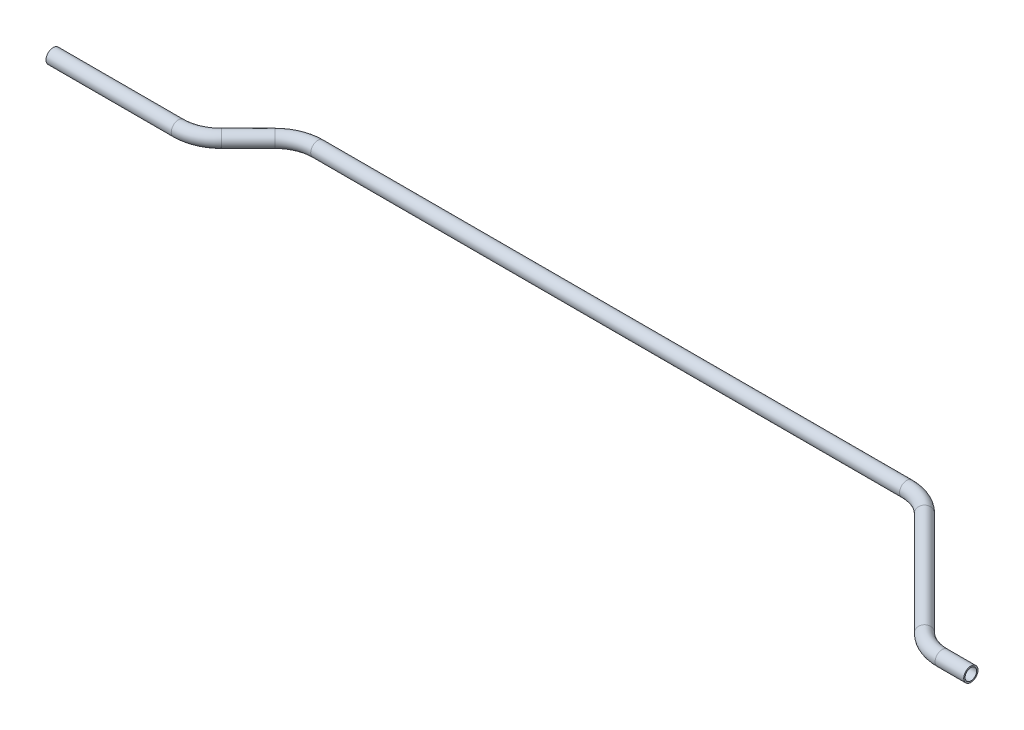
ISO-10303-21;
HEADER;
FILE_DESCRIPTION(('STEP AP214'),'2;1');
FILE_NAME('part.step','',(''),(''),'','','');
FILE_SCHEMA(('AUTOMOTIVE_DESIGN { 1 0 10303 214 1 1 1 1 }'));
ENDSEC;
DATA;
#1=APPLICATION_CONTEXT('core data for automotive mechanical design processes');
#2=APPLICATION_PROTOCOL_DEFINITION('international standard','automotive_design',2000,#1);
#3=PRODUCT_CONTEXT('',#1,'mechanical');
#4=PRODUCT('Part','Part','',(#3));
#5=PRODUCT_RELATED_PRODUCT_CATEGORY('part','',(#4));
#6=PRODUCT_DEFINITION_FORMATION('','',#4);
#7=PRODUCT_DEFINITION_CONTEXT('part definition',#1,'design');
#8=PRODUCT_DEFINITION('design','',#6,#7);
#9=PRODUCT_DEFINITION_SHAPE('','',#8);
#10=(LENGTH_UNIT() NAMED_UNIT(*) SI_UNIT(.MILLI.,.METRE.));
#11=(NAMED_UNIT(*) PLANE_ANGLE_UNIT() SI_UNIT($,.RADIAN.));
#12=(NAMED_UNIT(*) SI_UNIT($,.STERADIAN.) SOLID_ANGLE_UNIT());
#13=UNCERTAINTY_MEASURE_WITH_UNIT(LENGTH_MEASURE(1.E-05),#10,'distance_accuracy_value','');
#14=(GEOMETRIC_REPRESENTATION_CONTEXT(3) GLOBAL_UNCERTAINTY_ASSIGNED_CONTEXT((#13)) GLOBAL_UNIT_ASSIGNED_CONTEXT((#10,
#11,#12)) REPRESENTATION_CONTEXT('',''));
#15=CARTESIAN_POINT('',(0.,0.,0.));
#16=DIRECTION('',(0.,0.,1.));
#17=DIRECTION('',(1.,0.,0.));
#18=AXIS2_PLACEMENT_3D('',#15,#16,#17);
#19=CARTESIAN_POINT('',(0.,0.,0.));
#20=DIRECTION('',(1.,0.,0.));
#21=DIRECTION('',(0.,0.,-1.));
#22=AXIS2_PLACEMENT_3D('',#19,#20,#21);
#23=CYLINDRICAL_SURFACE('',#22,6.35);
#24=CARTESIAN_POINT('',(111.218463273585,0.,0.));
#25=DIRECTION('',(1.,0.,0.));
#26=DIRECTION('',(0.,0.,-1.));
#27=AXIS2_PLACEMENT_3D('',#24,#25,#26);
#28=CIRCLE('',#27,6.35);
#29=CARTESIAN_POINT('',(111.218463273585,0.,6.34999999999999));
#30=VERTEX_POINT('',#29);
#31=EDGE_CURVE('E60',#30,#30,#28,.T.);
#32=ORIENTED_EDGE('',*,*,#31,.F.);
#33=EDGE_LOOP('',(#32));
#34=FACE_BOUND('',#33,.T.);
#35=CARTESIAN_POINT('',(0.,0.,0.));
#36=DIRECTION('',(1.,0.,0.));
#37=DIRECTION('',(0.,0.,-1.));
#38=AXIS2_PLACEMENT_3D('',#35,#36,#37);
#39=CIRCLE('',#38,6.35);
#40=CARTESIAN_POINT('',(0.,0.,-6.35));
#41=VERTEX_POINT('',#40);
#42=EDGE_CURVE('E57',#41,#41,#39,.T.);
#43=ORIENTED_EDGE('',*,*,#42,.T.);
#44=EDGE_LOOP('',(#43));
#45=FACE_BOUND('',#44,.T.);
#46=ADVANCED_FACE('F36',(#34,#45),#23,.T.);
#47=CARTESIAN_POINT('',(111.218463273585,0.,-38.1));
#48=DIRECTION('',(0.,1.,0.));
#49=DIRECTION('',(0.,0.,1.));
#50=AXIS2_PLACEMENT_3D('',#47,#48,#49);
#51=TOROIDAL_SURFACE('',#50,38.1,6.35);
#52=CARTESIAN_POINT('',(138.159231636793,0.,-11.1592316367926));
#53=DIRECTION('',(0.707106781186547,0.,-0.707106781186549));
#54=DIRECTION('',(-0.707106781186549,0.,-0.707106781186547));
#55=AXIS2_PLACEMENT_3D('',#52,#53,#54);
#56=CIRCLE('',#55,6.35);
#57=CARTESIAN_POINT('',(142.649359697327,0.,-6.66910357625801));
#58=VERTEX_POINT('',#57);
#59=EDGE_CURVE('E63',#58,#58,#56,.T.);
#60=CARTESIAN_POINT('',(111.218463273585,0.,-38.1));
#61=DIRECTION('',(0.,1.,0.));
#62=DIRECTION('',(0.,0.,1.));
#63=AXIS2_PLACEMENT_3D('',#60,#61,#62);
#64=CIRCLE('',#63,44.45);
#65=EDGE_CURVE('',#30,#58,#64,.T.);
#66=ORIENTED_EDGE('',*,*,#31,.T.);
#67=ORIENTED_EDGE('',*,*,#59,.F.);
#68=ORIENTED_EDGE('',*,*,#65,.T.);
#69=ORIENTED_EDGE('',*,*,#65,.F.);
#70=EDGE_LOOP('',(#66,#68,#67,#69));
#71=FACE_BOUND('',#70,.T.);
#72=ADVANCED_FACE('F120',(#71),#51,.T.);
#73=CARTESIAN_POINT('',(138.159231636793,0.,-11.1592316367926));
#74=DIRECTION('',(0.707106781186546,0.,-0.70710678118655));
#75=DIRECTION('',(-0.70710678118655,0.,-0.707106781186546));
#76=AXIS2_PLACEMENT_3D('',#73,#74,#75);
#77=CYLINDRICAL_SURFACE('',#76,6.35);
#78=CARTESIAN_POINT('',(161.984627154807,0.,-34.9846271548074));
#79=DIRECTION('',(0.707106781186545,0.,-0.70710678118655));
#80=DIRECTION('',(-0.70710678118655,0.,-0.707106781186545));
#81=AXIS2_PLACEMENT_3D('',#78,#79,#80);
#82=CIRCLE('',#81,6.35);
#83=CARTESIAN_POINT('',(157.494499094273,0.,-39.4747552153419));
#84=VERTEX_POINT('',#83);
#85=EDGE_CURVE('E66',#84,#84,#82,.T.);
#86=ORIENTED_EDGE('',*,*,#85,.F.);
#87=EDGE_LOOP('',(#86));
#88=FACE_BOUND('',#87,.T.);
#89=ORIENTED_EDGE('',*,*,#59,.T.);
#90=EDGE_LOOP('',(#89));
#91=FACE_BOUND('',#90,.T.);
#92=ADVANCED_FACE('F124',(#88,#91),#77,.T.);
#93=CARTESIAN_POINT('',(188.925395518015,0.,-8.04385879159999));
#94=DIRECTION('',(0.,-1.,0.));
#95=DIRECTION('',(0.,0.,-1.));
#96=AXIS2_PLACEMENT_3D('',#93,#94,#95);
#97=TOROIDAL_SURFACE('',#96,38.1,6.35);
#98=CARTESIAN_POINT('',(188.925395518015,0.,-46.1438587916));
#99=DIRECTION('',(1.,0.,0.));
#100=DIRECTION('',(0.,0.,-1.));
#101=AXIS2_PLACEMENT_3D('',#98,#99,#100);
#102=CIRCLE('',#101,6.35);
#103=CARTESIAN_POINT('',(188.925395518015,0.,-52.4938587916));
#104=VERTEX_POINT('',#103);
#105=EDGE_CURVE('E69',#104,#104,#102,.T.);
#106=CARTESIAN_POINT('',(188.925395518015,0.,-8.04385879159999));
#107=DIRECTION('',(0.,-1.,0.));
#108=DIRECTION('',(0.,0.,-1.));
#109=AXIS2_PLACEMENT_3D('',#106,#107,#108);
#110=CIRCLE('',#109,44.45);
#111=EDGE_CURVE('',#84,#104,#110,.T.);
#112=ORIENTED_EDGE('',*,*,#85,.T.);
#113=ORIENTED_EDGE('',*,*,#105,.F.);
#114=ORIENTED_EDGE('',*,*,#111,.T.);
#115=ORIENTED_EDGE('',*,*,#111,.F.);
#116=EDGE_LOOP('',(#112,#114,#113,#115));
#117=FACE_BOUND('',#116,.T.);
#118=ADVANCED_FACE('F128',(#117),#97,.T.);
#119=CARTESIAN_POINT('',(188.925395518015,0.,-46.1438587916));
#120=DIRECTION('',(1.,0.,0.));
#121=DIRECTION('',(0.,0.,-1.));
#122=AXIS2_PLACEMENT_3D('',#119,#120,#121);
#123=CYLINDRICAL_SURFACE('',#122,6.35);
#124=CARTESIAN_POINT('',(711.81332533877,0.,-46.1438587916));
#125=DIRECTION('',(1.,0.,0.));
#126=DIRECTION('',(0.,0.,-1.));
#127=AXIS2_PLACEMENT_3D('',#124,#125,#126);
#128=CIRCLE('',#127,6.35);
#129=CARTESIAN_POINT('',(711.81332533877,0.,-52.4938587916));
#130=VERTEX_POINT('',#129);
#131=EDGE_CURVE('E72',#130,#130,#128,.T.);
#132=ORIENTED_EDGE('',*,*,#131,.F.);
#133=EDGE_LOOP('',(#132));
#134=FACE_BOUND('',#133,.T.);
#135=ORIENTED_EDGE('',*,*,#105,.T.);
#136=EDGE_LOOP('',(#135));
#137=FACE_BOUND('',#136,.T.);
#138=ADVANCED_FACE('F132',(#134,#137),#123,.T.);
#139=CARTESIAN_POINT('',(711.81332533877,0.,-8.04385879159999));
#140=DIRECTION('',(0.,-1.,0.));
#141=DIRECTION('',(0.,0.,-1.));
#142=AXIS2_PLACEMENT_3D('',#139,#140,#141);
#143=TOROIDAL_SURFACE('',#142,38.1,6.35);
#144=CARTESIAN_POINT('',(738.754093701978,0.,-34.9846271548074));
#145=DIRECTION('',(0.707106781186545,0.,0.70710678118655));
#146=DIRECTION('',(0.70710678118655,0.,-0.707106781186545));
#147=AXIS2_PLACEMENT_3D('',#144,#145,#146);
#148=CIRCLE('',#147,6.35);
#149=CARTESIAN_POINT('',(743.244221762512,0.,-39.474755215342));
#150=VERTEX_POINT('',#149);
#151=EDGE_CURVE('E75',#150,#150,#148,.T.);
#152=CARTESIAN_POINT('',(711.81332533877,0.,-8.04385879159999));
#153=DIRECTION('',(0.,-1.,0.));
#154=DIRECTION('',(0.,0.,-1.));
#155=AXIS2_PLACEMENT_3D('',#152,#153,#154);
#156=CIRCLE('',#155,44.45);
#157=EDGE_CURVE('',#130,#150,#156,.T.);
#158=ORIENTED_EDGE('',*,*,#131,.T.);
#159=ORIENTED_EDGE('',*,*,#151,.F.);
#160=ORIENTED_EDGE('',*,*,#157,.T.);
#161=ORIENTED_EDGE('',*,*,#157,.F.);
#162=EDGE_LOOP('',(#158,#160,#159,#161));
#163=FACE_BOUND('',#162,.T.);
#164=ADVANCED_FACE('F94',(#163),#143,.T.);
#165=CARTESIAN_POINT('',(738.754093701978,0.,-34.9846271548074));
#166=DIRECTION('',(0.707106781186547,0.,0.707106781186548));
#167=DIRECTION('',(0.707106781186548,0.,-0.707106781186547));
#168=AXIS2_PLACEMENT_3D('',#165,#166,#167);
#169=CYLINDRICAL_SURFACE('',#168,6.35);
#170=CARTESIAN_POINT('',(830.735630428392,0.,56.9969095716073));
#171=DIRECTION('',(0.707106781186547,0.,0.707106781186548));
#172=DIRECTION('',(0.707106781186548,0.,-0.707106781186547));
#173=AXIS2_PLACEMENT_3D('',#170,#171,#172);
#174=CIRCLE('',#173,6.35);
#175=CARTESIAN_POINT('',(826.245502367857,0.,61.4870376321419));
#176=VERTEX_POINT('',#175);
#177=EDGE_CURVE('E77',#176,#176,#174,.T.);
#178=ORIENTED_EDGE('',*,*,#177,.F.);
#179=EDGE_LOOP('',(#178));
#180=FACE_BOUND('',#179,.T.);
#181=ORIENTED_EDGE('',*,*,#151,.T.);
#182=EDGE_LOOP('',(#181));
#183=FACE_BOUND('',#182,.T.);
#184=ADVANCED_FACE('F87',(#180,#183),#169,.T.);
#185=CARTESIAN_POINT('',(857.676398791599,0.,30.0561412084));
#186=DIRECTION('',(0.,1.,0.));
#187=DIRECTION('',(0.,0.,1.));
#188=AXIS2_PLACEMENT_3D('',#185,#186,#187);
#189=TOROIDAL_SURFACE('',#188,38.0999999999999,6.35);
#190=CARTESIAN_POINT('',(857.676398791599,0.,68.1561412083999));
#191=DIRECTION('',(1.,0.,0.));
#192=DIRECTION('',(0.,0.,-1.));
#193=AXIS2_PLACEMENT_3D('',#190,#191,#192);
#194=CIRCLE('',#193,6.35);
#195=CARTESIAN_POINT('',(857.676398791599,0.,74.5061412083999));
#196=VERTEX_POINT('',#195);
#197=EDGE_CURVE('E40',#196,#196,#194,.T.);
#198=CARTESIAN_POINT('',(857.676398791599,0.,30.0561412084));
#199=DIRECTION('',(0.,1.,0.));
#200=DIRECTION('',(0.,0.,1.));
#201=AXIS2_PLACEMENT_3D('',#198,#199,#200);
#202=CIRCLE('',#201,44.4499999999999);
#203=EDGE_CURVE('',#176,#196,#202,.T.);
#204=ORIENTED_EDGE('',*,*,#177,.T.);
#205=ORIENTED_EDGE('',*,*,#197,.F.);
#206=ORIENTED_EDGE('',*,*,#203,.T.);
#207=ORIENTED_EDGE('',*,*,#203,.F.);
#208=EDGE_LOOP('',(#204,#206,#205,#207));
#209=FACE_BOUND('',#208,.T.);
#210=ADVANCED_FACE('F85',(#209),#189,.T.);
#211=CARTESIAN_POINT('',(857.676398791599,0.,68.1561412084));
#212=DIRECTION('',(1.,0.,0.));
#213=DIRECTION('',(0.,0.,-1.));
#214=AXIS2_PLACEMENT_3D('',#211,#212,#213);
#215=CYLINDRICAL_SURFACE('',#214,6.35);
#216=CARTESIAN_POINT('',(883.076398791599,0.,68.1561412084));
#217=DIRECTION('',(1.,0.,0.));
#218=DIRECTION('',(0.,0.,-1.));
#219=AXIS2_PLACEMENT_3D('',#216,#217,#218);
#220=CIRCLE('',#219,6.35);
#221=CARTESIAN_POINT('',(883.076398791599,0.,61.8061412084));
#222=VERTEX_POINT('',#221);
#223=EDGE_CURVE('E53',#222,#222,#220,.T.);
#224=ORIENTED_EDGE('',*,*,#223,.F.);
#225=EDGE_LOOP('',(#224));
#226=FACE_BOUND('',#225,.T.);
#227=ORIENTED_EDGE('',*,*,#197,.T.);
#228=EDGE_LOOP('',(#227));
#229=FACE_BOUND('',#228,.T.);
#230=ADVANCED_FACE('F38',(#226,#229),#215,.T.);
#231=CARTESIAN_POINT('',(0.,0.,0.));
#232=DIRECTION('',(1.,0.,0.));
#233=DIRECTION('',(0.,0.,-1.));
#234=AXIS2_PLACEMENT_3D('',#231,#232,#233);
#235=PLANE('',#234);
#236=CARTESIAN_POINT('',(0.,0.,0.));
#237=DIRECTION('',(1.,0.,0.));
#238=DIRECTION('',(0.,0.,-1.));
#239=AXIS2_PLACEMENT_3D('',#236,#237,#238);
#240=CIRCLE('',#239,5.1054);
#241=CARTESIAN_POINT('',(0.,0.,-5.1054));
#242=VERTEX_POINT('',#241);
#243=EDGE_CURVE('E56',#242,#242,#240,.F.);
#244=ORIENTED_EDGE('',*,*,#243,.F.);
#245=EDGE_LOOP('',(#244));
#246=FACE_BOUND('',#245,.T.);
#247=ORIENTED_EDGE('',*,*,#42,.F.);
#248=EDGE_LOOP('',(#247));
#249=FACE_BOUND('',#248,.T.);
#250=ADVANCED_FACE('F92',(#246,#249),#235,.F.);
#251=CARTESIAN_POINT('',(883.076398791599,0.,68.1561412084));
#252=DIRECTION('',(1.,0.,0.));
#253=DIRECTION('',(0.,0.,-1.));
#254=AXIS2_PLACEMENT_3D('',#251,#252,#253);
#255=PLANE('',#254);
#256=CARTESIAN_POINT('',(883.076398791599,0.,68.1561412084));
#257=DIRECTION('',(1.,0.,0.));
#258=DIRECTION('',(0.,0.,-1.));
#259=AXIS2_PLACEMENT_3D('',#256,#257,#258);
#260=CIRCLE('',#259,5.1054);
#261=CARTESIAN_POINT('',(883.076398791599,0.,63.0507412084));
#262=VERTEX_POINT('',#261);
#263=EDGE_CURVE('E10',#262,#262,#260,.F.);
#264=ORIENTED_EDGE('',*,*,#263,.T.);
#265=EDGE_LOOP('',(#264));
#266=FACE_BOUND('',#265,.T.);
#267=ORIENTED_EDGE('',*,*,#223,.T.);
#268=EDGE_LOOP('',(#267));
#269=FACE_BOUND('',#268,.T.);
#270=ADVANCED_FACE('F111',(#266,#269),#255,.T.);
#271=CARTESIAN_POINT('',(0.,0.,0.));
#272=DIRECTION('',(1.,0.,0.));
#273=DIRECTION('',(0.,0.,-1.));
#274=AXIS2_PLACEMENT_3D('',#271,#272,#273);
#275=CYLINDRICAL_SURFACE('',#274,5.1054);
#276=CARTESIAN_POINT('',(111.218463273585,0.,0.));
#277=DIRECTION('',(1.,0.,0.));
#278=DIRECTION('',(0.,0.,-1.));
#279=AXIS2_PLACEMENT_3D('',#276,#277,#278);
#280=CIRCLE('',#279,5.1054);
#281=CARTESIAN_POINT('',(111.218463273585,0.,5.10539999999999));
#282=VERTEX_POINT('',#281);
#283=EDGE_CURVE('E285',#282,#282,#280,.F.);
#284=ORIENTED_EDGE('',*,*,#283,.F.);
#285=EDGE_LOOP('',(#284));
#286=FACE_BOUND('',#285,.T.);
#287=ORIENTED_EDGE('',*,*,#243,.T.);
#288=EDGE_LOOP('',(#287));
#289=FACE_BOUND('',#288,.T.);
#290=ADVANCED_FACE('F114',(#286,#289),#275,.F.);
#291=CARTESIAN_POINT('',(111.218463273585,0.,-38.1));
#292=DIRECTION('',(0.,1.,0.));
#293=DIRECTION('',(0.,0.,1.));
#294=AXIS2_PLACEMENT_3D('',#291,#292,#293);
#295=TOROIDAL_SURFACE('',#294,38.1,5.1054);
#296=CARTESIAN_POINT('',(138.159231636793,0.,-11.1592316367926));
#297=DIRECTION('',(0.707106781186547,0.,-0.707106781186549));
#298=DIRECTION('',(-0.707106781186549,0.,-0.707106781186547));
#299=AXIS2_PLACEMENT_3D('',#296,#297,#298);
#300=CIRCLE('',#299,5.1054);
#301=CARTESIAN_POINT('',(141.769294597462,0.,-7.54916867612278));
#302=VERTEX_POINT('',#301);
#303=EDGE_CURVE('E282',#302,#302,#300,.F.);
#304=CARTESIAN_POINT('',(111.218463273585,0.,-38.1));
#305=DIRECTION('',(0.,1.,0.));
#306=DIRECTION('',(0.,0.,1.));
#307=AXIS2_PLACEMENT_3D('',#304,#305,#306);
#308=CIRCLE('',#307,43.2054);
#309=EDGE_CURVE('',#282,#302,#308,.T.);
#310=ORIENTED_EDGE('',*,*,#283,.T.);
#311=ORIENTED_EDGE('',*,*,#303,.F.);
#312=ORIENTED_EDGE('',*,*,#309,.T.);
#313=ORIENTED_EDGE('',*,*,#309,.F.);
#314=EDGE_LOOP('',(#310,#312,#311,#313));
#315=FACE_BOUND('',#314,.T.);
#316=ADVANCED_FACE('F193',(#315),#295,.F.);
#317=CARTESIAN_POINT('',(138.159231636793,0.,-11.1592316367926));
#318=DIRECTION('',(0.707106781186546,0.,-0.70710678118655));
#319=DIRECTION('',(-0.70710678118655,0.,-0.707106781186546));
#320=AXIS2_PLACEMENT_3D('',#317,#318,#319);
#321=CYLINDRICAL_SURFACE('',#320,5.1054);
#322=CARTESIAN_POINT('',(161.984627154807,0.,-34.9846271548074));
#323=DIRECTION('',(0.707106781186545,0.,-0.70710678118655));
#324=DIRECTION('',(-0.70710678118655,0.,-0.707106781186545));
#325=AXIS2_PLACEMENT_3D('',#322,#323,#324);
#326=CIRCLE('',#325,5.1054);
#327=CARTESIAN_POINT('',(158.374564194137,0.,-38.5946901154772));
#328=VERTEX_POINT('',#327);
#329=EDGE_CURVE('E279',#328,#328,#326,.F.);
#330=ORIENTED_EDGE('',*,*,#329,.F.);
#331=EDGE_LOOP('',(#330));
#332=FACE_BOUND('',#331,.T.);
#333=ORIENTED_EDGE('',*,*,#303,.T.);
#334=EDGE_LOOP('',(#333));
#335=FACE_BOUND('',#334,.T.);
#336=ADVANCED_FACE('F203',(#332,#335),#321,.F.);
#337=CARTESIAN_POINT('',(188.925395518015,0.,-8.04385879159999));
#338=DIRECTION('',(0.,-1.,0.));
#339=DIRECTION('',(0.,0.,-1.));
#340=AXIS2_PLACEMENT_3D('',#337,#338,#339);
#341=TOROIDAL_SURFACE('',#340,38.1,5.1054);
#342=CARTESIAN_POINT('',(188.925395518015,0.,-46.1438587916));
#343=DIRECTION('',(1.,0.,0.));
#344=DIRECTION('',(0.,0.,-1.));
#345=AXIS2_PLACEMENT_3D('',#342,#343,#344);
#346=CIRCLE('',#345,5.1054);
#347=CARTESIAN_POINT('',(188.925395518015,0.,-51.2492587916));
#348=VERTEX_POINT('',#347);
#349=EDGE_CURVE('E274',#348,#348,#346,.F.);
#350=CARTESIAN_POINT('',(188.925395518015,0.,-8.04385879159999));
#351=DIRECTION('',(0.,-1.,0.));
#352=DIRECTION('',(0.,0.,-1.));
#353=AXIS2_PLACEMENT_3D('',#350,#351,#352);
#354=CIRCLE('',#353,43.2054);
#355=EDGE_CURVE('',#328,#348,#354,.T.);
#356=ORIENTED_EDGE('',*,*,#329,.T.);
#357=ORIENTED_EDGE('',*,*,#349,.F.);
#358=ORIENTED_EDGE('',*,*,#355,.T.);
#359=ORIENTED_EDGE('',*,*,#355,.F.);
#360=EDGE_LOOP('',(#356,#358,#357,#359));
#361=FACE_BOUND('',#360,.T.);
#362=ADVANCED_FACE('F213',(#361),#341,.F.);
#363=CARTESIAN_POINT('',(188.925395518015,0.,-46.1438587916));
#364=DIRECTION('',(1.,0.,0.));
#365=DIRECTION('',(0.,0.,-1.));
#366=AXIS2_PLACEMENT_3D('',#363,#364,#365);
#367=CYLINDRICAL_SURFACE('',#366,5.1054);
#368=CARTESIAN_POINT('',(711.81332533877,0.,-46.1438587916));
#369=DIRECTION('',(1.,0.,0.));
#370=DIRECTION('',(0.,0.,-1.));
#371=AXIS2_PLACEMENT_3D('',#368,#369,#370);
#372=CIRCLE('',#371,5.1054);
#373=CARTESIAN_POINT('',(711.81332533877,0.,-51.2492587916));
#374=VERTEX_POINT('',#373);
#375=EDGE_CURVE('E271',#374,#374,#372,.F.);
#376=ORIENTED_EDGE('',*,*,#375,.F.);
#377=EDGE_LOOP('',(#376));
#378=FACE_BOUND('',#377,.T.);
#379=ORIENTED_EDGE('',*,*,#349,.T.);
#380=EDGE_LOOP('',(#379));
#381=FACE_BOUND('',#380,.T.);
#382=ADVANCED_FACE('F223',(#378,#381),#367,.F.);
#383=CARTESIAN_POINT('',(711.81332533877,0.,-8.04385879159999));
#384=DIRECTION('',(0.,-1.,0.));
#385=DIRECTION('',(0.,0.,-1.));
#386=AXIS2_PLACEMENT_3D('',#383,#384,#385);
#387=TOROIDAL_SURFACE('',#386,38.1,5.1054);
#388=CARTESIAN_POINT('',(738.754093701978,0.,-34.9846271548074));
#389=DIRECTION('',(0.707106781186545,0.,0.70710678118655));
#390=DIRECTION('',(0.70710678118655,0.,-0.707106781186545));
#391=AXIS2_PLACEMENT_3D('',#388,#389,#390);
#392=CIRCLE('',#391,5.1054);
#393=CARTESIAN_POINT('',(742.364156662647,0.,-38.5946901154772));
#394=VERTEX_POINT('',#393);
#395=EDGE_CURVE('E270',#394,#394,#392,.F.);
#396=CARTESIAN_POINT('',(711.81332533877,0.,-8.04385879159999));
#397=DIRECTION('',(0.,-1.,0.));
#398=DIRECTION('',(0.,0.,-1.));
#399=AXIS2_PLACEMENT_3D('',#396,#397,#398);
#400=CIRCLE('',#399,43.2054);
#401=EDGE_CURVE('',#374,#394,#400,.T.);
#402=ORIENTED_EDGE('',*,*,#375,.T.);
#403=ORIENTED_EDGE('',*,*,#395,.F.);
#404=ORIENTED_EDGE('',*,*,#401,.T.);
#405=ORIENTED_EDGE('',*,*,#401,.F.);
#406=EDGE_LOOP('',(#402,#404,#403,#405));
#407=FACE_BOUND('',#406,.T.);
#408=ADVANCED_FACE('F233',(#407),#387,.F.);
#409=CARTESIAN_POINT('',(738.754093701978,0.,-34.9846271548074));
#410=DIRECTION('',(0.707106781186547,0.,0.707106781186548));
#411=DIRECTION('',(0.707106781186548,0.,-0.707106781186547));
#412=AXIS2_PLACEMENT_3D('',#409,#410,#411);
#413=CYLINDRICAL_SURFACE('',#412,5.1054);
#414=CARTESIAN_POINT('',(830.735630428392,0.,56.9969095716073));
#415=DIRECTION('',(0.707106781186547,0.,0.707106781186548));
#416=DIRECTION('',(0.707106781186548,0.,-0.707106781186547));
#417=AXIS2_PLACEMENT_3D('',#414,#415,#416);
#418=CIRCLE('',#417,5.1054);
#419=CARTESIAN_POINT('',(827.125567467722,0.,60.6069725322772));
#420=VERTEX_POINT('',#419);
#421=EDGE_CURVE('E49',#420,#420,#418,.F.);
#422=ORIENTED_EDGE('',*,*,#421,.F.);
#423=EDGE_LOOP('',(#422));
#424=FACE_BOUND('',#423,.T.);
#425=ORIENTED_EDGE('',*,*,#395,.T.);
#426=EDGE_LOOP('',(#425));
#427=FACE_BOUND('',#426,.T.);
#428=ADVANCED_FACE('F105',(#424,#427),#413,.F.);
#429=CARTESIAN_POINT('',(857.676398791599,0.,30.0561412084));
#430=DIRECTION('',(0.,1.,0.));
#431=DIRECTION('',(0.,0.,1.));
#432=AXIS2_PLACEMENT_3D('',#429,#430,#431);
#433=TOROIDAL_SURFACE('',#432,38.0999999999999,5.1054);
#434=CARTESIAN_POINT('',(857.676398791599,0.,68.1561412083999));
#435=DIRECTION('',(1.,0.,0.));
#436=DIRECTION('',(0.,0.,-1.));
#437=AXIS2_PLACEMENT_3D('',#434,#435,#436);
#438=CIRCLE('',#437,5.1054);
#439=CARTESIAN_POINT('',(857.676398791599,0.,73.2615412083999));
#440=VERTEX_POINT('',#439);
#441=EDGE_CURVE('E44',#440,#440,#438,.F.);
#442=CARTESIAN_POINT('',(857.676398791599,0.,30.0561412084));
#443=DIRECTION('',(0.,1.,0.));
#444=DIRECTION('',(0.,0.,1.));
#445=AXIS2_PLACEMENT_3D('',#442,#443,#444);
#446=CIRCLE('',#445,43.2053999999999);
#447=EDGE_CURVE('',#420,#440,#446,.T.);
#448=ORIENTED_EDGE('',*,*,#421,.T.);
#449=ORIENTED_EDGE('',*,*,#441,.F.);
#450=ORIENTED_EDGE('',*,*,#447,.T.);
#451=ORIENTED_EDGE('',*,*,#447,.F.);
#452=EDGE_LOOP('',(#448,#450,#449,#451));
#453=FACE_BOUND('',#452,.T.);
#454=ADVANCED_FACE('F99',(#453),#433,.F.);
#455=CARTESIAN_POINT('',(857.676398791599,0.,68.1561412084));
#456=DIRECTION('',(1.,0.,0.));
#457=DIRECTION('',(0.,0.,-1.));
#458=AXIS2_PLACEMENT_3D('',#455,#456,#457);
#459=CYLINDRICAL_SURFACE('',#458,5.1054);
#460=ORIENTED_EDGE('',*,*,#263,.F.);
#461=EDGE_LOOP('',(#460));
#462=FACE_BOUND('',#461,.T.);
#463=ORIENTED_EDGE('',*,*,#441,.T.);
#464=EDGE_LOOP('',(#463));
#465=FACE_BOUND('',#464,.T.);
#466=ADVANCED_FACE('F97',(#462,#465),#459,.F.);
#467=CLOSED_SHELL('',(#46,#72,#92,#118,#138,#164,#184,#210,#230,#250,#270,#290,#316,#336,#362,
#382,#408,#428,#454,#466));
#468=MANIFOLD_SOLID_BREP('B2',#467);
#469=ADVANCED_BREP_SHAPE_REPRESENTATION('',(#18,#468),#14);
#470=SHAPE_DEFINITION_REPRESENTATION(#9,#469);
ENDSEC;
END-ISO-10303-21;
